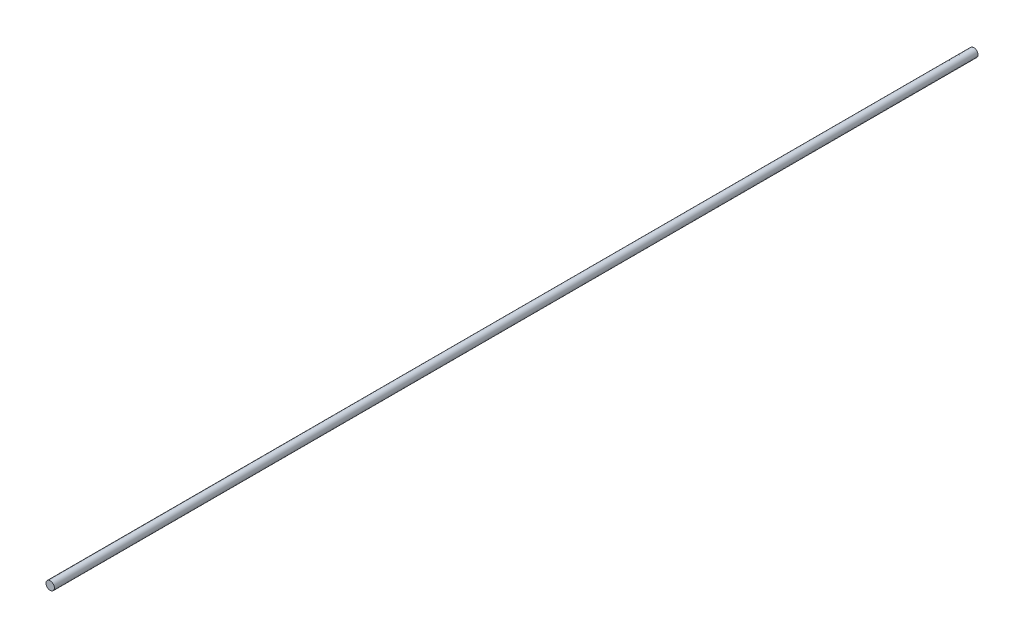
ISO-10303-21;
HEADER;
FILE_DESCRIPTION(('STEP AP214'),'2;1');
FILE_NAME('part.step','',(''),(''),'','','');
FILE_SCHEMA(('AUTOMOTIVE_DESIGN { 1 0 10303 214 1 1 1 1 }'));
ENDSEC;
DATA;
#1=APPLICATION_CONTEXT('core data for automotive mechanical design processes');
#2=APPLICATION_PROTOCOL_DEFINITION('international standard','automotive_design',2000,#1);
#3=PRODUCT_CONTEXT('',#1,'mechanical');
#4=PRODUCT('Part','Part','',(#3));
#5=PRODUCT_RELATED_PRODUCT_CATEGORY('part','',(#4));
#6=PRODUCT_DEFINITION_FORMATION('','',#4);
#7=PRODUCT_DEFINITION_CONTEXT('part definition',#1,'design');
#8=PRODUCT_DEFINITION('design','',#6,#7);
#9=PRODUCT_DEFINITION_SHAPE('','',#8);
#10=(LENGTH_UNIT() NAMED_UNIT(*) SI_UNIT(.MILLI.,.METRE.));
#11=(NAMED_UNIT(*) PLANE_ANGLE_UNIT() SI_UNIT($,.RADIAN.));
#12=(NAMED_UNIT(*) SI_UNIT($,.STERADIAN.) SOLID_ANGLE_UNIT());
#13=UNCERTAINTY_MEASURE_WITH_UNIT(LENGTH_MEASURE(1.E-05),#10,'distance_accuracy_value','');
#14=(GEOMETRIC_REPRESENTATION_CONTEXT(3) GLOBAL_UNCERTAINTY_ASSIGNED_CONTEXT((#13)) GLOBAL_UNIT_ASSIGNED_CONTEXT((#10,
#11,#12)) REPRESENTATION_CONTEXT('',''));
#15=CARTESIAN_POINT('',(0.,0.,0.));
#16=DIRECTION('',(0.,0.,1.));
#17=DIRECTION('',(1.,0.,0.));
#18=AXIS2_PLACEMENT_3D('',#15,#16,#17);
#19=CARTESIAN_POINT('',(0.,0.,110.));
#20=DIRECTION('',(0.,0.,-1.));
#21=DIRECTION('',(-1.,0.,0.));
#22=AXIS2_PLACEMENT_3D('',#19,#20,#21);
#23=CYLINDRICAL_SURFACE('',#22,0.5);
#24=CARTESIAN_POINT('',(0.,0.,110.));
#25=DIRECTION('',(0.,0.,1.));
#26=DIRECTION('',(1.,0.,0.));
#27=AXIS2_PLACEMENT_3D('',#24,#25,#26);
#28=CIRCLE('',#27,0.5);
#29=CARTESIAN_POINT('',(0.5,0.,110.));
#30=VERTEX_POINT('',#29);
#31=EDGE_CURVE('E10',#30,#30,#28,.T.);
#32=ORIENTED_EDGE('',*,*,#31,.F.);
#33=EDGE_LOOP('',(#32));
#34=FACE_BOUND('',#33,.T.);
#35=CARTESIAN_POINT('',(0.,0.,0.));
#36=DIRECTION('',(0.,0.,1.));
#37=DIRECTION('',(1.,0.,0.));
#38=AXIS2_PLACEMENT_3D('',#35,#36,#37);
#39=CIRCLE('',#38,0.5);
#40=CARTESIAN_POINT('',(0.5,0.,0.));
#41=VERTEX_POINT('',#40);
#42=EDGE_CURVE('E37',#41,#41,#39,.T.);
#43=ORIENTED_EDGE('',*,*,#42,.T.);
#44=EDGE_LOOP('',(#43));
#45=FACE_BOUND('',#44,.T.);
#46=ADVANCED_FACE('F34',(#34,#45),#23,.T.);
#47=CARTESIAN_POINT('',(0.,0.,110.));
#48=DIRECTION('',(0.,0.,1.));
#49=DIRECTION('',(1.,0.,0.));
#50=AXIS2_PLACEMENT_3D('',#47,#48,#49);
#51=PLANE('',#50);
#52=ORIENTED_EDGE('',*,*,#31,.T.);
#53=EDGE_LOOP('',(#52));
#54=FACE_BOUND('',#53,.T.);
#55=ADVANCED_FACE('F49',(#54),#51,.T.);
#56=CARTESIAN_POINT('',(0.,0.,0.));
#57=DIRECTION('',(0.,0.,1.));
#58=DIRECTION('',(1.,0.,0.));
#59=AXIS2_PLACEMENT_3D('',#56,#57,#58);
#60=PLANE('',#59);
#61=ORIENTED_EDGE('',*,*,#42,.F.);
#62=EDGE_LOOP('',(#61));
#63=FACE_BOUND('',#62,.T.);
#64=ADVANCED_FACE('F47',(#63),#60,.F.);
#65=CLOSED_SHELL('',(#46,#55,#64));
#66=MANIFOLD_SOLID_BREP('B2',#65);
#67=ADVANCED_BREP_SHAPE_REPRESENTATION('',(#18,#66),#14);
#68=SHAPE_DEFINITION_REPRESENTATION(#9,#67);
ENDSEC;
END-ISO-10303-21;
